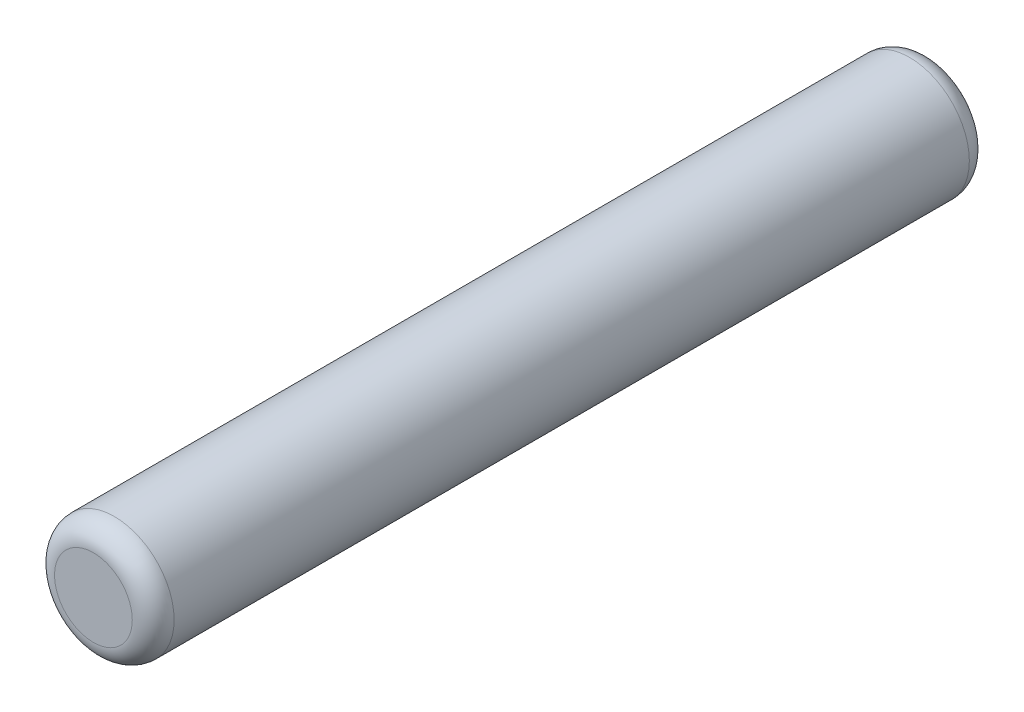
ISO-10303-21;
HEADER;
FILE_DESCRIPTION(('STEP AP214'),'2;1');
FILE_NAME('part.step','',(''),(''),'','','');
FILE_SCHEMA(('AUTOMOTIVE_DESIGN { 1 0 10303 214 1 1 1 1 }'));
ENDSEC;
DATA;
#1=APPLICATION_CONTEXT('core data for automotive mechanical design processes');
#2=APPLICATION_PROTOCOL_DEFINITION('international standard','automotive_design',2000,#1);
#3=PRODUCT_CONTEXT('',#1,'mechanical');
#4=PRODUCT('Part','Part','',(#3));
#5=PRODUCT_RELATED_PRODUCT_CATEGORY('part','',(#4));
#6=PRODUCT_DEFINITION_FORMATION('','',#4);
#7=PRODUCT_DEFINITION_CONTEXT('part definition',#1,'design');
#8=PRODUCT_DEFINITION('design','',#6,#7);
#9=PRODUCT_DEFINITION_SHAPE('','',#8);
#10=(LENGTH_UNIT() NAMED_UNIT(*) SI_UNIT(.MILLI.,.METRE.));
#11=(NAMED_UNIT(*) PLANE_ANGLE_UNIT() SI_UNIT($,.RADIAN.));
#12=(NAMED_UNIT(*) SI_UNIT($,.STERADIAN.) SOLID_ANGLE_UNIT());
#13=UNCERTAINTY_MEASURE_WITH_UNIT(LENGTH_MEASURE(1.E-05),#10,'distance_accuracy_value','');
#14=(GEOMETRIC_REPRESENTATION_CONTEXT(3) GLOBAL_UNCERTAINTY_ASSIGNED_CONTEXT((#13)) GLOBAL_UNIT_ASSIGNED_CONTEXT((#10,
#11,#12)) REPRESENTATION_CONTEXT('',''));
#15=CARTESIAN_POINT('',(0.,0.,0.));
#16=DIRECTION('',(0.,0.,1.));
#17=DIRECTION('',(1.,0.,0.));
#18=AXIS2_PLACEMENT_3D('',#15,#16,#17);
#19=CARTESIAN_POINT('',(0.,0.,7.));
#20=DIRECTION('',(0.,0.,-1.));
#21=DIRECTION('',(-1.,0.,0.));
#22=AXIS2_PLACEMENT_3D('',#19,#20,#21);
#23=CYLINDRICAL_SURFACE('',#22,1.);
#24=CARTESIAN_POINT('',(0.,0.,-6.65));
#25=DIRECTION('',(0.,0.,1.));
#26=DIRECTION('',(1.,0.,0.));
#27=AXIS2_PLACEMENT_3D('',#24,#25,#26);
#28=CIRCLE('',#27,1.);
#29=CARTESIAN_POINT('',(1.,0.,-6.65));
#30=VERTEX_POINT('',#29);
#31=EDGE_CURVE('E41',#30,#30,#28,.T.);
#32=ORIENTED_EDGE('',*,*,#31,.T.);
#33=EDGE_LOOP('',(#32));
#34=FACE_BOUND('',#33,.T.);
#35=CARTESIAN_POINT('',(0.,0.,6.65));
#36=DIRECTION('',(0.,0.,1.));
#37=DIRECTION('',(1.,0.,0.));
#38=AXIS2_PLACEMENT_3D('',#35,#36,#37);
#39=CIRCLE('',#38,1.);
#40=CARTESIAN_POINT('',(1.,0.,6.65));
#41=VERTEX_POINT('',#40);
#42=EDGE_CURVE('E45',#41,#41,#39,.F.);
#43=ORIENTED_EDGE('',*,*,#42,.T.);
#44=EDGE_LOOP('',(#43));
#45=FACE_BOUND('',#44,.T.);
#46=ADVANCED_FACE('F30',(#34,#45),#23,.T.);
#47=CARTESIAN_POINT('',(0.,0.,7.));
#48=DIRECTION('',(0.,0.,1.));
#49=DIRECTION('',(1.,0.,0.));
#50=AXIS2_PLACEMENT_3D('',#47,#48,#49);
#51=PLANE('',#50);
#52=CARTESIAN_POINT('',(0.,0.,7.));
#53=DIRECTION('',(0.,0.,1.));
#54=DIRECTION('',(1.,0.,0.));
#55=AXIS2_PLACEMENT_3D('',#52,#53,#54);
#56=CIRCLE('',#55,0.65);
#57=CARTESIAN_POINT('',(0.65,0.,7.));
#58=VERTEX_POINT('',#57);
#59=EDGE_CURVE('E10',#58,#58,#56,.T.);
#60=ORIENTED_EDGE('',*,*,#59,.T.);
#61=EDGE_LOOP('',(#60));
#62=FACE_BOUND('',#61,.T.);
#63=ADVANCED_FACE('F61',(#62),#51,.T.);
#64=CARTESIAN_POINT('',(0.,0.,-7.));
#65=DIRECTION('',(0.,0.,1.));
#66=DIRECTION('',(1.,0.,0.));
#67=AXIS2_PLACEMENT_3D('',#64,#65,#66);
#68=PLANE('',#67);
#69=CARTESIAN_POINT('',(0.,0.,-7.));
#70=DIRECTION('',(0.,0.,1.));
#71=DIRECTION('',(1.,0.,0.));
#72=AXIS2_PLACEMENT_3D('',#69,#70,#71);
#73=CIRCLE('',#72,0.65);
#74=CARTESIAN_POINT('',(0.65,0.,-7.));
#75=VERTEX_POINT('',#74);
#76=EDGE_CURVE('E37',#75,#75,#73,.F.);
#77=ORIENTED_EDGE('',*,*,#76,.T.);
#78=EDGE_LOOP('',(#77));
#79=FACE_BOUND('',#78,.T.);
#80=ADVANCED_FACE('F58',(#79),#68,.F.);
#81=CARTESIAN_POINT('',(0.,0.,-6.65));
#82=DIRECTION('',(0.,0.,1.));
#83=DIRECTION('',(1.,0.,0.));
#84=AXIS2_PLACEMENT_3D('',#81,#82,#83);
#85=TOROIDAL_SURFACE('',#84,0.65,0.35);
#86=ORIENTED_EDGE('',*,*,#76,.F.);
#87=EDGE_LOOP('',(#86));
#88=FACE_BOUND('',#87,.T.);
#89=ORIENTED_EDGE('',*,*,#31,.F.);
#90=EDGE_LOOP('',(#89));
#91=FACE_BOUND('',#90,.T.);
#92=ADVANCED_FACE('F54',(#88,#91),#85,.T.);
#93=CARTESIAN_POINT('',(0.,0.,6.65));
#94=DIRECTION('',(0.,0.,1.));
#95=DIRECTION('',(1.,0.,0.));
#96=AXIS2_PLACEMENT_3D('',#93,#94,#95);
#97=TOROIDAL_SURFACE('',#96,0.65,0.35);
#98=ORIENTED_EDGE('',*,*,#42,.F.);
#99=EDGE_LOOP('',(#98));
#100=FACE_BOUND('',#99,.T.);
#101=ORIENTED_EDGE('',*,*,#59,.F.);
#102=EDGE_LOOP('',(#101));
#103=FACE_BOUND('',#102,.T.);
#104=ADVANCED_FACE('F32',(#100,#103),#97,.T.);
#105=CLOSED_SHELL('',(#46,#63,#80,#92,#104));
#106=MANIFOLD_SOLID_BREP('B2',#105);
#107=ADVANCED_BREP_SHAPE_REPRESENTATION('',(#18,#106),#14);
#108=SHAPE_DEFINITION_REPRESENTATION(#9,#107);
ENDSEC;
END-ISO-10303-21;
